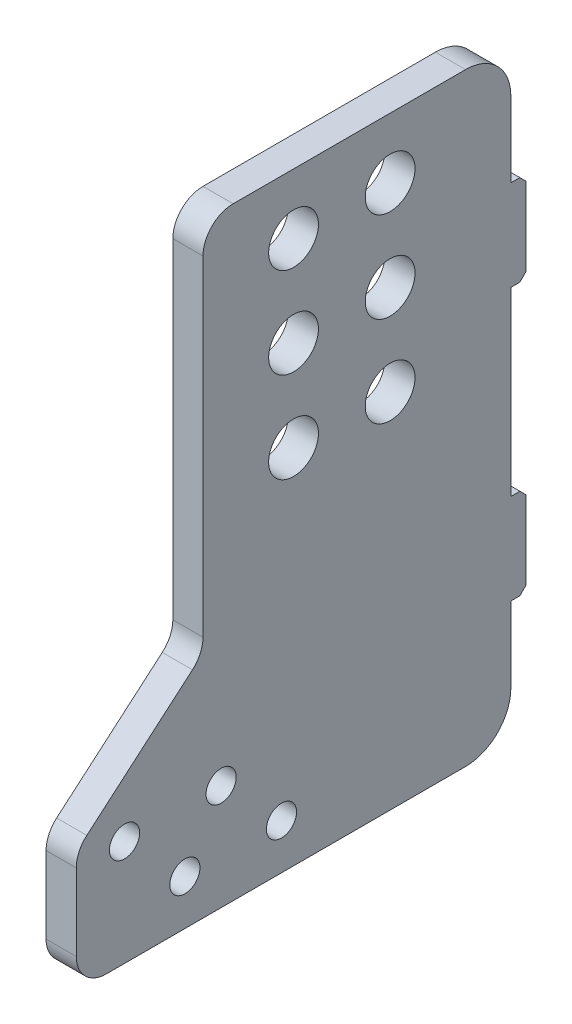
ISO-10303-21;
HEADER;
FILE_DESCRIPTION(('STEP AP214'),'2;1');
FILE_NAME('part.step','',(''),(''),'','','');
FILE_SCHEMA(('AUTOMOTIVE_DESIGN { 1 0 10303 214 1 1 1 1 }'));
ENDSEC;
DATA;
#1=APPLICATION_CONTEXT('core data for automotive mechanical design processes');
#2=APPLICATION_PROTOCOL_DEFINITION('international standard','automotive_design',2000,#1);
#3=PRODUCT_CONTEXT('',#1,'mechanical');
#4=PRODUCT('Part','Part','',(#3));
#5=PRODUCT_RELATED_PRODUCT_CATEGORY('part','',(#4));
#6=PRODUCT_DEFINITION_FORMATION('','',#4);
#7=PRODUCT_DEFINITION_CONTEXT('part definition',#1,'design');
#8=PRODUCT_DEFINITION('design','',#6,#7);
#9=PRODUCT_DEFINITION_SHAPE('','',#8);
#10=(LENGTH_UNIT() NAMED_UNIT(*) SI_UNIT(.MILLI.,.METRE.));
#11=(NAMED_UNIT(*) PLANE_ANGLE_UNIT() SI_UNIT($,.RADIAN.));
#12=(NAMED_UNIT(*) SI_UNIT($,.STERADIAN.) SOLID_ANGLE_UNIT());
#13=UNCERTAINTY_MEASURE_WITH_UNIT(LENGTH_MEASURE(1.E-05),#10,'distance_accuracy_value','');
#14=(GEOMETRIC_REPRESENTATION_CONTEXT(3) GLOBAL_UNCERTAINTY_ASSIGNED_CONTEXT((#13)) GLOBAL_UNIT_ASSIGNED_CONTEXT((#10,
#11,#12)) REPRESENTATION_CONTEXT('',''));
#15=CARTESIAN_POINT('',(0.,0.,0.));
#16=DIRECTION('',(0.,0.,1.));
#17=DIRECTION('',(1.,0.,0.));
#18=AXIS2_PLACEMENT_3D('',#15,#16,#17);
#19=CARTESIAN_POINT('',(23.5,-100.,0.));
#20=DIRECTION('',(0.,0.,1.));
#21=DIRECTION('',(0.,-1.,0.));
#22=AXIS2_PLACEMENT_3D('',#19,#20,#21);
#23=PLANE('',#22);
#24=DIRECTION('',(0.,1.,0.));
#25=VECTOR('',#24,1.);
#26=CARTESIAN_POINT('',(23.5,-100.,0.));
#27=LINE('',#26,#25);
#28=CARTESIAN_POINT('',(23.5,-30.,0.));
#29=VERTEX_POINT('',#28);
#30=CARTESIAN_POINT('',(23.5,30.0000000000001,0.));
#31=VERTEX_POINT('',#30);
#32=EDGE_CURVE('E220',#29,#31,#27,.T.);
#33=ORIENTED_EDGE('',*,*,#32,.F.);
#34=CARTESIAN_POINT('',(23.5,-30.,0.));
#35=CARTESIAN_POINT('',(13.5,-30.,0.));
#36=B_SPLINE_CURVE_WITH_KNOTS('',1,(#34,#35),.UNSPECIFIED.,.F.,.F.,(2,2),(0.,0.125),.UNSPECIFIED.);
#37=CARTESIAN_POINT('',(13.5,-30.,0.));
#38=VERTEX_POINT('',#37);
#39=EDGE_CURVE('E207',#29,#38,#36,.T.);
#40=ORIENTED_EDGE('',*,*,#39,.T.);
#41=DIRECTION('',(0.,1.,0.));
#42=VECTOR('',#41,1.);
#43=CARTESIAN_POINT('',(13.5,-100.,0.));
#44=LINE('',#43,#42);
#45=CARTESIAN_POINT('',(13.5,30.0000000000002,0.));
#46=VERTEX_POINT('',#45);
#47=EDGE_CURVE('E218',#38,#46,#44,.T.);
#48=ORIENTED_EDGE('',*,*,#47,.T.);
#49=CARTESIAN_POINT('',(13.5,30.0000000000002,0.));
#50=CARTESIAN_POINT('',(23.5,30.0000000000002,0.));
#51=B_SPLINE_CURVE_WITH_KNOTS('',1,(#49,#50),.UNSPECIFIED.,.F.,.F.,(2,2),(0.5,0.625),.UNSPECIFIED.);
#52=EDGE_CURVE('E372',#46,#31,#51,.T.);
#53=ORIENTED_EDGE('',*,*,#52,.T.);
#54=EDGE_LOOP('',(#33,#40,#48,#53));
#55=FACE_BOUND('',#54,.T.);
#56=ADVANCED_FACE('F38',(#55),#23,.F.);
#57=CARTESIAN_POINT('',(13.5,60.0000000000002,0.));
#58=VERTEX_POINT('',#57);
#59=CARTESIAN_POINT('',(13.5,85.0000000000002,0.));
#60=VERTEX_POINT('',#59);
#61=EDGE_CURVE('E230',#58,#60,#44,.T.);
#62=ORIENTED_EDGE('',*,*,#61,.T.);
#63=DIRECTION('',(-1.,0.,0.));
#64=VECTOR('',#63,1.);
#65=CARTESIAN_POINT('',(23.5,85.0000000000002,0.));
#66=LINE('',#65,#64);
#67=CARTESIAN_POINT('',(23.5,85.0000000000002,0.));
#68=VERTEX_POINT('',#67);
#69=EDGE_CURVE('E279',#60,#68,#66,.F.);
#70=ORIENTED_EDGE('',*,*,#69,.T.);
#71=CARTESIAN_POINT('',(23.5,60.0000000000002,0.));
#72=VERTEX_POINT('',#71);
#73=EDGE_CURVE('E328',#72,#68,#27,.T.);
#74=ORIENTED_EDGE('',*,*,#73,.F.);
#75=CARTESIAN_POINT('',(23.5,60.0000000000002,0.));
#76=CARTESIAN_POINT('',(13.5,60.0000000000002,0.));
#77=B_SPLINE_CURVE_WITH_KNOTS('',1,(#75,#76),.UNSPECIFIED.,.F.,.F.,(2,2),(0.,0.125),.UNSPECIFIED.);
#78=EDGE_CURVE('E368',#72,#58,#77,.T.);
#79=ORIENTED_EDGE('',*,*,#78,.T.);
#80=EDGE_LOOP('',(#62,#70,#74,#79));
#81=FACE_BOUND('',#80,.T.);
#82=ADVANCED_FACE('F354',(#81),#23,.F.);
#83=CARTESIAN_POINT('',(23.5,90.0000000000002,92.));
#84=DIRECTION('',(1.,0.,0.));
#85=DIRECTION('',(0.,0.,-1.));
#86=AXIS2_PLACEMENT_3D('',#83,#84,#85);
#87=PLANE('',#86);
#88=CARTESIAN_POINT('',(23.5,-65.0000000000005,128.));
#89=DIRECTION('',(1.,0.,0.));
#90=DIRECTION('',(0.,0.,-1.));
#91=AXIS2_PLACEMENT_3D('',#88,#89,#90);
#92=CIRCLE('',#91,4.99999999999999);
#93=CARTESIAN_POINT('',(23.5,-65.0000000000005,123.));
#94=VERTEX_POINT('',#93);
#95=EDGE_CURVE('E420',#94,#94,#92,.T.);
#96=ORIENTED_EDGE('',*,*,#95,.F.);
#97=EDGE_LOOP('',(#96));
#98=FACE_BOUND('',#97,.T.);
#99=CARTESIAN_POINT('',(23.5,-85.,76.));
#100=DIRECTION('',(1.,0.,0.));
#101=DIRECTION('',(0.,0.,-1.));
#102=AXIS2_PLACEMENT_3D('',#99,#100,#101);
#103=CIRCLE('',#102,5.00000000000002);
#104=CARTESIAN_POINT('',(23.5,-85.,71.));
#105=VERTEX_POINT('',#104);
#106=EDGE_CURVE('E432',#105,#105,#103,.T.);
#107=ORIENTED_EDGE('',*,*,#106,.F.);
#108=EDGE_LOOP('',(#107));
#109=FACE_BOUND('',#108,.T.);
#110=CARTESIAN_POINT('',(23.5,50.0000000000002,40.));
#111=DIRECTION('',(1.,0.,0.));
#112=DIRECTION('',(0.,0.,-1.));
#113=AXIS2_PLACEMENT_3D('',#110,#111,#112);
#114=CIRCLE('',#113,8.25000000000001);
#115=CARTESIAN_POINT('',(23.5,50.0000000000002,31.75));
#116=VERTEX_POINT('',#115);
#117=EDGE_CURVE('E444',#116,#116,#114,.T.);
#118=ORIENTED_EDGE('',*,*,#117,.F.);
#119=EDGE_LOOP('',(#118));
#120=FACE_BOUND('',#119,.T.);
#121=CARTESIAN_POINT('',(23.5,50.,72.));
#122=DIRECTION('',(1.,0.,0.));
#123=DIRECTION('',(0.,0.,-1.));
#124=AXIS2_PLACEMENT_3D('',#121,#122,#123);
#125=CIRCLE('',#124,8.25);
#126=CARTESIAN_POINT('',(23.5,50.,63.75));
#127=VERTEX_POINT('',#126);
#128=EDGE_CURVE('E456',#127,#127,#125,.T.);
#129=ORIENTED_EDGE('',*,*,#128,.F.);
#130=EDGE_LOOP('',(#129));
#131=FACE_BOUND('',#130,.T.);
#132=CARTESIAN_POINT('',(23.5,80.,72.));
#133=DIRECTION('',(1.,0.,0.));
#134=DIRECTION('',(0.,0.,-1.));
#135=AXIS2_PLACEMENT_3D('',#132,#133,#134);
#136=CIRCLE('',#135,8.25000000000001);
#137=CARTESIAN_POINT('',(23.5,80.,63.75));
#138=VERTEX_POINT('',#137);
#139=EDGE_CURVE('E466',#138,#138,#136,.T.);
#140=ORIENTED_EDGE('',*,*,#139,.F.);
#141=EDGE_LOOP('',(#140));
#142=FACE_BOUND('',#141,.T.);
#143=DIRECTION('',(0.,-0.650791373455971,0.759256602365295));
#144=VECTOR('',#143,1.);
#145=CARTESIAN_POINT('',(23.5,-23.9999999999998,102.));
#146=LINE('',#145,#144);
#147=CARTESIAN_POINT('',(23.5,-26.9932167989486,105.49208626544));
#148=VERTEX_POINT('',#147);
#149=CARTESIAN_POINT('',(23.5,-57.0067832010512,140.50791373456));
#150=VERTEX_POINT('',#149);
#151=EDGE_CURVE('E303',#148,#150,#146,.T.);
#152=ORIENTED_EDGE('',*,*,#151,.T.);
#153=CARTESIAN_POINT('',(23.5,-64.5993492247041,134.));
#154=DIRECTION('',(1.,0.,0.));
#155=DIRECTION('',(0.,0.,-1.));
#156=AXIS2_PLACEMENT_3D('',#153,#154,#155);
#157=CIRCLE('',#156,10.);
#158=CARTESIAN_POINT('',(23.5,-64.5993492247041,144.));
#159=VERTEX_POINT('',#158);
#160=EDGE_CURVE('E290',#150,#159,#157,.T.);
#161=ORIENTED_EDGE('',*,*,#160,.T.);
#162=DIRECTION('',(0.,-1.,0.));
#163=VECTOR('',#162,1.);
#164=CARTESIAN_POINT('',(23.5,-60.,144.));
#165=LINE('',#164,#163);
#166=CARTESIAN_POINT('',(23.5,-90.,144.));
#167=VERTEX_POINT('',#166);
#168=EDGE_CURVE('E307',#159,#167,#165,.T.);
#169=ORIENTED_EDGE('',*,*,#168,.T.);
#170=CARTESIAN_POINT('',(23.5,-90.,134.));
#171=DIRECTION('',(1.,0.,0.));
#172=DIRECTION('',(0.,0.,-1.));
#173=AXIS2_PLACEMENT_3D('',#170,#171,#172);
#174=CIRCLE('',#173,9.99999999999999);
#175=CARTESIAN_POINT('',(23.5,-100.,134.));
#176=VERTEX_POINT('',#175);
#177=EDGE_CURVE('E254',#167,#176,#174,.T.);
#178=ORIENTED_EDGE('',*,*,#177,.T.);
#179=DIRECTION('',(0.,0.,-1.));
#180=VECTOR('',#179,1.);
#181=CARTESIAN_POINT('',(23.5,-100.,134.));
#182=LINE('',#181,#180);
#183=CARTESIAN_POINT('',(23.5,-100.,15.));
#184=VERTEX_POINT('',#183);
#185=EDGE_CURVE('E249',#176,#184,#182,.T.);
#186=ORIENTED_EDGE('',*,*,#185,.T.);
#187=CARTESIAN_POINT('',(23.5,-85.,15.));
#188=DIRECTION('',(1.,0.,0.));
#189=DIRECTION('',(0.,0.,-1.));
#190=AXIS2_PLACEMENT_3D('',#187,#188,#189);
#191=CIRCLE('',#190,15.);
#192=CARTESIAN_POINT('',(23.5,-85.,0.));
#193=VERTEX_POINT('',#192);
#194=EDGE_CURVE('E274',#184,#193,#191,.T.);
#195=ORIENTED_EDGE('',*,*,#194,.T.);
#196=CARTESIAN_POINT('',(23.5,-60.,0.));
#197=VERTEX_POINT('',#196);
#198=EDGE_CURVE('E332',#193,#197,#27,.T.);
#199=ORIENTED_EDGE('',*,*,#198,.T.);
#200=DIRECTION('',(0.,0.,1.));
#201=VECTOR('',#200,1.);
#202=CARTESIAN_POINT('',(23.5,-60.,-4.99999999999999));
#203=LINE('',#202,#201);
#204=CARTESIAN_POINT('',(23.5,-60.,-2.99999999999999));
#205=VERTEX_POINT('',#204);
#206=EDGE_CURVE('E518',#205,#197,#203,.T.);
#207=ORIENTED_EDGE('',*,*,#206,.F.);
#208=DIRECTION('',(0.,-0.707106781186548,0.707106781186547));
#209=VECTOR('',#208,1.);
#210=CARTESIAN_POINT('',(23.5,-59.,-3.99999999999999));
#211=LINE('',#210,#209);
#212=CARTESIAN_POINT('',(23.5,-58.,-4.99999999999999));
#213=VERTEX_POINT('',#212);
#214=EDGE_CURVE('E540',#205,#213,#211,.F.);
#215=ORIENTED_EDGE('',*,*,#214,.T.);
#216=CARTESIAN_POINT('',(23.5,-60.,-4.99999999999999));
#217=CARTESIAN_POINT('',(23.5,-30.,-4.99999999999999));
#218=B_SPLINE_CURVE_WITH_KNOTS('',1,(#216,#217),.UNSPECIFIED.,.F.,.F.,(2,2),(0.625,1.),.UNSPECIFIED.);
#219=CARTESIAN_POINT('',(23.5,-32.,-4.99999999999999));
#220=VERTEX_POINT('',#219);
#221=EDGE_CURVE('E214',#213,#220,#218,.T.);
#222=ORIENTED_EDGE('',*,*,#221,.T.);
#223=DIRECTION('',(0.,-0.707106781186548,-0.707106781186547));
#224=VECTOR('',#223,1.);
#225=CARTESIAN_POINT('',(23.5,-46.,-19.));
#226=LINE('',#225,#224);
#227=CARTESIAN_POINT('',(23.5,-30.,-2.99999999999999));
#228=VERTEX_POINT('',#227);
#229=EDGE_CURVE('E538',#220,#228,#226,.F.);
#230=ORIENTED_EDGE('',*,*,#229,.T.);
#231=DIRECTION('',(0.,0.,1.));
#232=VECTOR('',#231,1.);
#233=CARTESIAN_POINT('',(23.5,-30.,-4.99999999999999));
#234=LINE('',#233,#232);
#235=EDGE_CURVE('E530',#228,#29,#234,.T.);
#236=ORIENTED_EDGE('',*,*,#235,.T.);
#237=ORIENTED_EDGE('',*,*,#32,.T.);
#238=DIRECTION('',(0.,0.,1.));
#239=VECTOR('',#238,1.);
#240=CARTESIAN_POINT('',(23.5,30.0000000000002,-4.99999999999999));
#241=LINE('',#240,#239);
#242=CARTESIAN_POINT('',(23.5,30.0000000000002,-2.99999999999999));
#243=VERTEX_POINT('',#242);
#244=EDGE_CURVE('E366',#243,#31,#241,.T.);
#245=ORIENTED_EDGE('',*,*,#244,.F.);
#246=DIRECTION('',(0.,-0.707106781186548,0.707106781186547));
#247=VECTOR('',#246,1.);
#248=CARTESIAN_POINT('',(23.5,31.0000000000002,-3.99999999999999));
#249=LINE('',#248,#247);
#250=CARTESIAN_POINT('',(23.5,32.0000000000002,-4.99999999999999));
#251=VERTEX_POINT('',#250);
#252=EDGE_CURVE('E401',#243,#251,#249,.F.);
#253=ORIENTED_EDGE('',*,*,#252,.T.);
#254=CARTESIAN_POINT('',(23.5,30.0000000000002,-4.99999999999999));
#255=CARTESIAN_POINT('',(23.5,60.0000000000002,-4.99999999999999));
#256=B_SPLINE_CURVE_WITH_KNOTS('',1,(#254,#255),.UNSPECIFIED.,.F.,.F.,(2,2),(0.625,1.),.UNSPECIFIED.);
#257=CARTESIAN_POINT('',(23.5,58.0000000000002,-4.99999999999999));
#258=VERTEX_POINT('',#257);
#259=EDGE_CURVE('E381',#251,#258,#256,.T.);
#260=ORIENTED_EDGE('',*,*,#259,.T.);
#261=DIRECTION('',(0.,-0.707106781186548,-0.707106781186547));
#262=VECTOR('',#261,1.);
#263=CARTESIAN_POINT('',(23.5,44.0000000000002,-19.));
#264=LINE('',#263,#262);
#265=CARTESIAN_POINT('',(23.5,60.0000000000002,-2.99999999999999));
#266=VERTEX_POINT('',#265);
#267=EDGE_CURVE('E361',#258,#266,#264,.F.);
#268=ORIENTED_EDGE('',*,*,#267,.T.);
#269=DIRECTION('',(0.,0.,1.));
#270=VECTOR('',#269,1.);
#271=CARTESIAN_POINT('',(23.5,60.0000000000002,-4.99999999999999));
#272=LINE('',#271,#270);
#273=EDGE_CURVE('E357',#266,#72,#272,.T.);
#274=ORIENTED_EDGE('',*,*,#273,.T.);
#275=ORIENTED_EDGE('',*,*,#73,.T.);
#276=CARTESIAN_POINT('',(23.5,85.0000000000002,15.));
#277=DIRECTION('',(1.,0.,0.));
#278=DIRECTION('',(0.,0.,-1.));
#279=AXIS2_PLACEMENT_3D('',#276,#277,#278);
#280=CIRCLE('',#279,15.);
#281=CARTESIAN_POINT('',(23.5,100.,15.));
#282=VERTEX_POINT('',#281);
#283=EDGE_CURVE('E272',#68,#282,#280,.T.);
#284=ORIENTED_EDGE('',*,*,#283,.T.);
#285=DIRECTION('',(0.,0.,1.));
#286=VECTOR('',#285,1.);
#287=CARTESIAN_POINT('',(23.5,100.,0.));
#288=LINE('',#287,#286);
#289=CARTESIAN_POINT('',(23.5,100.,92.));
#290=VERTEX_POINT('',#289);
#291=EDGE_CURVE('E337',#282,#290,#288,.T.);
#292=ORIENTED_EDGE('',*,*,#291,.T.);
#293=CARTESIAN_POINT('',(23.5,90.0000000000002,92.));
#294=DIRECTION('',(1.,0.,0.));
#295=DIRECTION('',(0.,0.,-1.));
#296=AXIS2_PLACEMENT_3D('',#293,#294,#295);
#297=CIRCLE('',#296,9.99999999999998);
#298=CARTESIAN_POINT('',(23.5,90.0000000000002,102.));
#299=VERTEX_POINT('',#298);
#300=EDGE_CURVE('E310',#290,#299,#297,.T.);
#301=ORIENTED_EDGE('',*,*,#300,.T.);
#302=DIRECTION('',(0.,-1.,0.));
#303=VECTOR('',#302,1.);
#304=CARTESIAN_POINT('',(23.5,90.0000000000002,102.));
#305=LINE('',#304,#303);
#306=CARTESIAN_POINT('',(23.5,-19.4006507752956,102.));
#307=VERTEX_POINT('',#306);
#308=EDGE_CURVE('E305',#299,#307,#305,.T.);
#309=ORIENTED_EDGE('',*,*,#308,.T.);
#310=CARTESIAN_POINT('',(23.5,-19.4006507752957,112.));
#311=DIRECTION('',(1.,0.,0.));
#312=DIRECTION('',(0.,0.,-1.));
#313=AXIS2_PLACEMENT_3D('',#310,#311,#312);
#314=CIRCLE('',#313,10.);
#315=EDGE_CURVE('E11',#307,#148,#314,.F.);
#316=ORIENTED_EDGE('',*,*,#315,.T.);
#317=EDGE_LOOP('',(#152,#161,#169,#178,#186,#195,#199,#207,#215,#222,#230,#236,#237,#245,#253,
#260,#268,#274,#275,#284,#292,#301,#309,#316));
#318=FACE_BOUND('',#317,.T.);
#319=CARTESIAN_POINT('',(23.5,80.0000000000002,40.));
#320=DIRECTION('',(1.,0.,0.));
#321=DIRECTION('',(0.,0.,-1.));
#322=AXIS2_PLACEMENT_3D('',#319,#320,#321);
#323=CIRCLE('',#322,8.25);
#324=CARTESIAN_POINT('',(23.5,80.0000000000002,31.75));
#325=VERTEX_POINT('',#324);
#326=EDGE_CURVE('E462',#325,#325,#323,.T.);
#327=ORIENTED_EDGE('',*,*,#326,.F.);
#328=EDGE_LOOP('',(#327));
#329=FACE_BOUND('',#328,.T.);
#330=CARTESIAN_POINT('',(23.5,20.,72.));
#331=DIRECTION('',(1.,0.,0.));
#332=DIRECTION('',(0.,0.,-1.));
#333=AXIS2_PLACEMENT_3D('',#330,#331,#332);
#334=CIRCLE('',#333,8.25);
#335=CARTESIAN_POINT('',(23.5,20.,63.75));
#336=VERTEX_POINT('',#335);
#337=EDGE_CURVE('E450',#336,#336,#334,.T.);
#338=ORIENTED_EDGE('',*,*,#337,.F.);
#339=EDGE_LOOP('',(#338));
#340=FACE_BOUND('',#339,.T.);
#341=CARTESIAN_POINT('',(23.5,20.0000000000002,40.));
#342=DIRECTION('',(1.,0.,0.));
#343=DIRECTION('',(0.,0.,-1.));
#344=AXIS2_PLACEMENT_3D('',#341,#342,#343);
#345=CIRCLE('',#344,8.25);
#346=CARTESIAN_POINT('',(23.5,20.0000000000002,31.75));
#347=VERTEX_POINT('',#346);
#348=EDGE_CURVE('E438',#347,#347,#345,.T.);
#349=ORIENTED_EDGE('',*,*,#348,.F.);
#350=EDGE_LOOP('',(#349));
#351=FACE_BOUND('',#350,.T.);
#352=CARTESIAN_POINT('',(23.5,-85.0000000000002,108.));
#353=DIRECTION('',(1.,0.,0.));
#354=DIRECTION('',(0.,0.,-1.));
#355=AXIS2_PLACEMENT_3D('',#352,#353,#354);
#356=CIRCLE('',#355,5.00000000000005);
#357=CARTESIAN_POINT('',(23.5,-85.0000000000002,103.));
#358=VERTEX_POINT('',#357);
#359=EDGE_CURVE('E426',#358,#358,#356,.T.);
#360=ORIENTED_EDGE('',*,*,#359,.F.);
#361=EDGE_LOOP('',(#360));
#362=FACE_BOUND('',#361,.T.);
#363=CARTESIAN_POINT('',(23.5,-65.0000000000003,96.));
#364=DIRECTION('',(1.,0.,0.));
#365=DIRECTION('',(0.,0.,-1.));
#366=AXIS2_PLACEMENT_3D('',#363,#364,#365);
#367=CIRCLE('',#366,5.00000000000005);
#368=CARTESIAN_POINT('',(23.5,-65.0000000000003,91.));
#369=VERTEX_POINT('',#368);
#370=EDGE_CURVE('E414',#369,#369,#367,.T.);
#371=ORIENTED_EDGE('',*,*,#370,.F.);
#372=EDGE_LOOP('',(#371));
#373=FACE_BOUND('',#372,.T.);
#374=ADVANCED_FACE('F301',(#98,#109,#120,#131,#142,#318,#329,#340,#351,#362,#373),#87,.T.);
#375=CARTESIAN_POINT('',(13.5,90.0000000000002,92.));
#376=DIRECTION('',(1.,0.,0.));
#377=DIRECTION('',(0.,0.,-1.));
#378=AXIS2_PLACEMENT_3D('',#375,#376,#377);
#379=PLANE('',#378);
#380=DIRECTION('',(0.,-1.,0.));
#381=VECTOR('',#380,1.);
#382=CARTESIAN_POINT('',(13.5,-60.,144.));
#383=LINE('',#382,#381);
#384=CARTESIAN_POINT('',(13.5,-64.5993492247041,144.));
#385=VERTEX_POINT('',#384);
#386=CARTESIAN_POINT('',(13.5,-90.,144.));
#387=VERTEX_POINT('',#386);
#388=EDGE_CURVE('E245',#385,#387,#383,.T.);
#389=ORIENTED_EDGE('',*,*,#388,.F.);
#390=CARTESIAN_POINT('',(13.5,-64.5993492247041,134.));
#391=DIRECTION('',(1.,0.,0.));
#392=DIRECTION('',(0.,0.,-1.));
#393=AXIS2_PLACEMENT_3D('',#390,#391,#392);
#394=CIRCLE('',#393,10.);
#395=CARTESIAN_POINT('',(13.5,-57.0067832010512,140.50791373456));
#396=VERTEX_POINT('',#395);
#397=EDGE_CURVE('E284',#385,#396,#394,.F.);
#398=ORIENTED_EDGE('',*,*,#397,.T.);
#399=DIRECTION('',(0.,-0.650791373455971,0.759256602365295));
#400=VECTOR('',#399,1.);
#401=CARTESIAN_POINT('',(13.5,-23.9999999999998,102.));
#402=LINE('',#401,#400);
#403=CARTESIAN_POINT('',(13.5,-26.9932167989486,105.49208626544));
#404=VERTEX_POINT('',#403);
#405=EDGE_CURVE('E243',#404,#396,#402,.T.);
#406=ORIENTED_EDGE('',*,*,#405,.F.);
#407=CARTESIAN_POINT('',(13.5,-19.4006507752957,112.));
#408=DIRECTION('',(1.,0.,0.));
#409=DIRECTION('',(0.,0.,-1.));
#410=AXIS2_PLACEMENT_3D('',#407,#408,#409);
#411=CIRCLE('',#410,10.);
#412=CARTESIAN_POINT('',(13.5,-19.4006507752956,102.));
#413=VERTEX_POINT('',#412);
#414=EDGE_CURVE('E46',#404,#413,#411,.T.);
#415=ORIENTED_EDGE('',*,*,#414,.T.);
#416=DIRECTION('',(0.,-1.,0.));
#417=VECTOR('',#416,1.);
#418=CARTESIAN_POINT('',(13.5,90.0000000000002,102.));
#419=LINE('',#418,#417);
#420=CARTESIAN_POINT('',(13.5,90.0000000000002,102.));
#421=VERTEX_POINT('',#420);
#422=EDGE_CURVE('E241',#421,#413,#419,.T.);
#423=ORIENTED_EDGE('',*,*,#422,.F.);
#424=CARTESIAN_POINT('',(13.5,90.0000000000002,92.));
#425=DIRECTION('',(1.,0.,0.));
#426=DIRECTION('',(0.,0.,-1.));
#427=AXIS2_PLACEMENT_3D('',#424,#425,#426);
#428=CIRCLE('',#427,9.99999999999998);
#429=CARTESIAN_POINT('',(13.5,100.,92.));
#430=VERTEX_POINT('',#429);
#431=EDGE_CURVE('E239',#430,#421,#428,.T.);
#432=ORIENTED_EDGE('',*,*,#431,.F.);
#433=DIRECTION('',(0.,0.,1.));
#434=VECTOR('',#433,1.);
#435=CARTESIAN_POINT('',(13.5,100.,0.));
#436=LINE('',#435,#434);
#437=CARTESIAN_POINT('',(13.5,100.,15.));
#438=VERTEX_POINT('',#437);
#439=EDGE_CURVE('E232',#438,#430,#436,.T.);
#440=ORIENTED_EDGE('',*,*,#439,.F.);
#441=CARTESIAN_POINT('',(13.5,85.0000000000002,15.));
#442=DIRECTION('',(1.,0.,0.));
#443=DIRECTION('',(0.,0.,-1.));
#444=AXIS2_PLACEMENT_3D('',#441,#442,#443);
#445=CIRCLE('',#444,15.);
#446=EDGE_CURVE('E266',#438,#60,#445,.F.);
#447=ORIENTED_EDGE('',*,*,#446,.T.);
#448=ORIENTED_EDGE('',*,*,#61,.F.);
#449=DIRECTION('',(0.,0.,1.));
#450=VECTOR('',#449,1.);
#451=CARTESIAN_POINT('',(13.5,60.0000000000002,-4.99999999999999));
#452=LINE('',#451,#450);
#453=CARTESIAN_POINT('',(13.5,60.0000000000002,-2.99999999999999));
#454=VERTEX_POINT('',#453);
#455=EDGE_CURVE('E371',#454,#58,#452,.T.);
#456=ORIENTED_EDGE('',*,*,#455,.F.);
#457=DIRECTION('',(0.,0.707106781186548,0.707106781186547));
#458=VECTOR('',#457,1.);
#459=CARTESIAN_POINT('',(13.5,59.0000000000002,-3.99999999999999));
#460=LINE('',#459,#458);
#461=CARTESIAN_POINT('',(13.5,58.0000000000002,-4.99999999999999));
#462=VERTEX_POINT('',#461);
#463=EDGE_CURVE('E407',#454,#462,#460,.F.);
#464=ORIENTED_EDGE('',*,*,#463,.T.);
#465=CARTESIAN_POINT('',(13.5,60.0000000000002,-4.99999999999999));
#466=CARTESIAN_POINT('',(13.5,30.0000000000002,-4.99999999999999));
#467=B_SPLINE_CURVE_WITH_KNOTS('',1,(#465,#466),.UNSPECIFIED.,.F.,.F.,(2,2),(0.125,0.5),.UNSPECIFIED.);
#468=CARTESIAN_POINT('',(13.5,32.0000000000002,-4.99999999999999));
#469=VERTEX_POINT('',#468);
#470=EDGE_CURVE('E374',#462,#469,#467,.T.);
#471=ORIENTED_EDGE('',*,*,#470,.T.);
#472=DIRECTION('',(0.,0.707106781186548,-0.707106781186547));
#473=VECTOR('',#472,1.);
#474=CARTESIAN_POINT('',(13.5,46.0000000000002,-19.));
#475=LINE('',#474,#473);
#476=CARTESIAN_POINT('',(13.5,30.0000000000002,-2.99999999999999));
#477=VERTEX_POINT('',#476);
#478=EDGE_CURVE('E409',#469,#477,#475,.F.);
#479=ORIENTED_EDGE('',*,*,#478,.T.);
#480=DIRECTION('',(0.,0.,1.));
#481=VECTOR('',#480,1.);
#482=CARTESIAN_POINT('',(13.5,30.0000000000002,-4.99999999999999));
#483=LINE('',#482,#481);
#484=EDGE_CURVE('E227',#477,#46,#483,.T.);
#485=ORIENTED_EDGE('',*,*,#484,.T.);
#486=ORIENTED_EDGE('',*,*,#47,.F.);
#487=DIRECTION('',(0.,0.,1.));
#488=VECTOR('',#487,1.);
#489=CARTESIAN_POINT('',(13.5,-30.,-4.99999999999999));
#490=LINE('',#489,#488);
#491=CARTESIAN_POINT('',(13.5,-30.,-2.99999999999999));
#492=VERTEX_POINT('',#491);
#493=EDGE_CURVE('E203',#492,#38,#490,.T.);
#494=ORIENTED_EDGE('',*,*,#493,.F.);
#495=DIRECTION('',(0.,0.707106781186548,0.707106781186547));
#496=VECTOR('',#495,1.);
#497=CARTESIAN_POINT('',(13.5,-31.,-3.99999999999999));
#498=LINE('',#497,#496);
#499=CARTESIAN_POINT('',(13.5,-32.,-4.99999999999999));
#500=VERTEX_POINT('',#499);
#501=EDGE_CURVE('E546',#492,#500,#498,.F.);
#502=ORIENTED_EDGE('',*,*,#501,.T.);
#503=CARTESIAN_POINT('',(13.5,-30.,-4.99999999999999));
#504=CARTESIAN_POINT('',(13.5,-60.,-4.99999999999999));
#505=B_SPLINE_CURVE_WITH_KNOTS('',1,(#503,#504),.UNSPECIFIED.,.F.,.F.,(2,2),(0.125,0.5),.UNSPECIFIED.);
#506=CARTESIAN_POINT('',(13.5,-58.,-4.99999999999999));
#507=VERTEX_POINT('',#506);
#508=EDGE_CURVE('E521',#500,#507,#505,.T.);
#509=ORIENTED_EDGE('',*,*,#508,.T.);
#510=DIRECTION('',(0.,0.707106781186548,-0.707106781186547));
#511=VECTOR('',#510,1.);
#512=CARTESIAN_POINT('',(13.5,-44.,-19.));
#513=LINE('',#512,#511);
#514=CARTESIAN_POINT('',(13.5,-60.,-2.99999999999999));
#515=VERTEX_POINT('',#514);
#516=EDGE_CURVE('E376',#507,#515,#513,.F.);
#517=ORIENTED_EDGE('',*,*,#516,.T.);
#518=DIRECTION('',(0.,0.,1.));
#519=VECTOR('',#518,1.);
#520=CARTESIAN_POINT('',(13.5,-60.,-4.99999999999999));
#521=LINE('',#520,#519);
#522=CARTESIAN_POINT('',(13.5,-60.,0.));
#523=VERTEX_POINT('',#522);
#524=EDGE_CURVE('E213',#515,#523,#521,.T.);
#525=ORIENTED_EDGE('',*,*,#524,.T.);
#526=CARTESIAN_POINT('',(13.5,-85.,0.));
#527=VERTEX_POINT('',#526);
#528=EDGE_CURVE('E229',#527,#523,#44,.T.);
#529=ORIENTED_EDGE('',*,*,#528,.F.);
#530=CARTESIAN_POINT('',(13.5,-85.,15.));
#531=DIRECTION('',(1.,0.,0.));
#532=DIRECTION('',(0.,0.,-1.));
#533=AXIS2_PLACEMENT_3D('',#530,#531,#532);
#534=CIRCLE('',#533,15.);
#535=CARTESIAN_POINT('',(13.5,-100.,15.));
#536=VERTEX_POINT('',#535);
#537=EDGE_CURVE('E268',#527,#536,#534,.F.);
#538=ORIENTED_EDGE('',*,*,#537,.T.);
#539=DIRECTION('',(0.,0.,-1.));
#540=VECTOR('',#539,1.);
#541=CARTESIAN_POINT('',(13.5,-100.,134.));
#542=LINE('',#541,#540);
#543=CARTESIAN_POINT('',(13.5,-100.,134.));
#544=VERTEX_POINT('',#543);
#545=EDGE_CURVE('E234',#544,#536,#542,.T.);
#546=ORIENTED_EDGE('',*,*,#545,.F.);
#547=CARTESIAN_POINT('',(13.5,-90.,134.));
#548=DIRECTION('',(1.,0.,0.));
#549=DIRECTION('',(0.,0.,-1.));
#550=AXIS2_PLACEMENT_3D('',#547,#548,#549);
#551=CIRCLE('',#550,9.99999999999999);
#552=EDGE_CURVE('E247',#387,#544,#551,.T.);
#553=ORIENTED_EDGE('',*,*,#552,.F.);
#554=EDGE_LOOP('',(#389,#398,#406,#415,#423,#432,#440,#447,#448,#456,#464,#471,#479,#485,#486,
#494,#502,#509,#517,#525,#529,#538,#546,#553));
#555=FACE_BOUND('',#554,.T.);
#556=CARTESIAN_POINT('',(13.5,80.,72.));
#557=DIRECTION('',(1.,0.,0.));
#558=DIRECTION('',(0.,0.,-1.));
#559=AXIS2_PLACEMENT_3D('',#556,#557,#558);
#560=CIRCLE('',#559,8.25000000000001);
#561=CARTESIAN_POINT('',(13.5,80.,63.75));
#562=VERTEX_POINT('',#561);
#563=EDGE_CURVE('E334',#562,#562,#560,.T.);
#564=ORIENTED_EDGE('',*,*,#563,.T.);
#565=EDGE_LOOP('',(#564));
#566=FACE_BOUND('',#565,.T.);
#567=CARTESIAN_POINT('',(13.5,80.0000000000002,40.));
#568=DIRECTION('',(1.,0.,0.));
#569=DIRECTION('',(0.,0.,-1.));
#570=AXIS2_PLACEMENT_3D('',#567,#568,#569);
#571=CIRCLE('',#570,8.25);
#572=CARTESIAN_POINT('',(13.5,80.0000000000002,31.75));
#573=VERTEX_POINT('',#572);
#574=EDGE_CURVE('E459',#573,#573,#571,.T.);
#575=ORIENTED_EDGE('',*,*,#574,.T.);
#576=EDGE_LOOP('',(#575));
#577=FACE_BOUND('',#576,.T.);
#578=CARTESIAN_POINT('',(13.5,50.,72.));
#579=DIRECTION('',(1.,0.,0.));
#580=DIRECTION('',(0.,0.,-1.));
#581=AXIS2_PLACEMENT_3D('',#578,#579,#580);
#582=CIRCLE('',#581,8.25);
#583=CARTESIAN_POINT('',(13.5,50.,63.75));
#584=VERTEX_POINT('',#583);
#585=EDGE_CURVE('E453',#584,#584,#582,.T.);
#586=ORIENTED_EDGE('',*,*,#585,.T.);
#587=EDGE_LOOP('',(#586));
#588=FACE_BOUND('',#587,.T.);
#589=CARTESIAN_POINT('',(13.5,20.,72.));
#590=DIRECTION('',(1.,0.,0.));
#591=DIRECTION('',(0.,0.,-1.));
#592=AXIS2_PLACEMENT_3D('',#589,#590,#591);
#593=CIRCLE('',#592,8.25);
#594=CARTESIAN_POINT('',(13.5,20.,63.75));
#595=VERTEX_POINT('',#594);
#596=EDGE_CURVE('E447',#595,#595,#593,.T.);
#597=ORIENTED_EDGE('',*,*,#596,.T.);
#598=EDGE_LOOP('',(#597));
#599=FACE_BOUND('',#598,.T.);
#600=CARTESIAN_POINT('',(13.5,50.0000000000002,40.));
#601=DIRECTION('',(1.,0.,0.));
#602=DIRECTION('',(0.,0.,-1.));
#603=AXIS2_PLACEMENT_3D('',#600,#601,#602);
#604=CIRCLE('',#603,8.25000000000001);
#605=CARTESIAN_POINT('',(13.5,50.0000000000002,31.75));
#606=VERTEX_POINT('',#605);
#607=EDGE_CURVE('E441',#606,#606,#604,.T.);
#608=ORIENTED_EDGE('',*,*,#607,.T.);
#609=EDGE_LOOP('',(#608));
#610=FACE_BOUND('',#609,.T.);
#611=CARTESIAN_POINT('',(13.5,20.0000000000002,40.));
#612=DIRECTION('',(1.,0.,0.));
#613=DIRECTION('',(0.,0.,-1.));
#614=AXIS2_PLACEMENT_3D('',#611,#612,#613);
#615=CIRCLE('',#614,8.25);
#616=CARTESIAN_POINT('',(13.5,20.0000000000002,31.75));
#617=VERTEX_POINT('',#616);
#618=EDGE_CURVE('E435',#617,#617,#615,.T.);
#619=ORIENTED_EDGE('',*,*,#618,.T.);
#620=EDGE_LOOP('',(#619));
#621=FACE_BOUND('',#620,.T.);
#622=CARTESIAN_POINT('',(13.5,-85.,76.));
#623=DIRECTION('',(1.,0.,0.));
#624=DIRECTION('',(0.,0.,-1.));
#625=AXIS2_PLACEMENT_3D('',#622,#623,#624);
#626=CIRCLE('',#625,5.00000000000002);
#627=CARTESIAN_POINT('',(13.5,-85.,71.));
#628=VERTEX_POINT('',#627);
#629=EDGE_CURVE('E429',#628,#628,#626,.T.);
#630=ORIENTED_EDGE('',*,*,#629,.T.);
#631=EDGE_LOOP('',(#630));
#632=FACE_BOUND('',#631,.T.);
#633=CARTESIAN_POINT('',(13.5,-85.0000000000002,108.));
#634=DIRECTION('',(1.,0.,0.));
#635=DIRECTION('',(0.,0.,-1.));
#636=AXIS2_PLACEMENT_3D('',#633,#634,#635);
#637=CIRCLE('',#636,5.00000000000005);
#638=CARTESIAN_POINT('',(13.5,-85.0000000000002,103.));
#639=VERTEX_POINT('',#638);
#640=EDGE_CURVE('E423',#639,#639,#637,.T.);
#641=ORIENTED_EDGE('',*,*,#640,.T.);
#642=EDGE_LOOP('',(#641));
#643=FACE_BOUND('',#642,.T.);
#644=CARTESIAN_POINT('',(13.5,-65.0000000000005,128.));
#645=DIRECTION('',(1.,0.,0.));
#646=DIRECTION('',(0.,0.,-1.));
#647=AXIS2_PLACEMENT_3D('',#644,#645,#646);
#648=CIRCLE('',#647,4.99999999999999);
#649=CARTESIAN_POINT('',(13.5,-65.0000000000005,123.));
#650=VERTEX_POINT('',#649);
#651=EDGE_CURVE('E417',#650,#650,#648,.T.);
#652=ORIENTED_EDGE('',*,*,#651,.T.);
#653=EDGE_LOOP('',(#652));
#654=FACE_BOUND('',#653,.T.);
#655=CARTESIAN_POINT('',(13.5,-65.0000000000003,96.));
#656=DIRECTION('',(1.,0.,0.));
#657=DIRECTION('',(0.,0.,-1.));
#658=AXIS2_PLACEMENT_3D('',#655,#656,#657);
#659=CIRCLE('',#658,5.00000000000005);
#660=CARTESIAN_POINT('',(13.5,-65.0000000000003,91.));
#661=VERTEX_POINT('',#660);
#662=EDGE_CURVE('E413',#661,#661,#659,.T.);
#663=ORIENTED_EDGE('',*,*,#662,.T.);
#664=EDGE_LOOP('',(#663));
#665=FACE_BOUND('',#664,.T.);
#666=ADVANCED_FACE('F224',(#555,#566,#577,#588,#599,#610,#621,#632,#643,#654,#665),#379,.F.);
#667=CARTESIAN_POINT('',(23.5,-100.,134.));
#668=DIRECTION('',(0.,1.,0.));
#669=DIRECTION('',(0.,0.,1.));
#670=AXIS2_PLACEMENT_3D('',#667,#668,#669);
#671=PLANE('',#670);
#672=ORIENTED_EDGE('',*,*,#545,.T.);
#673=DIRECTION('',(-1.,0.,0.));
#674=VECTOR('',#673,1.);
#675=CARTESIAN_POINT('',(23.5,-100.,15.));
#676=LINE('',#675,#674);
#677=EDGE_CURVE('E270',#536,#184,#676,.F.);
#678=ORIENTED_EDGE('',*,*,#677,.T.);
#679=ORIENTED_EDGE('',*,*,#185,.F.);
#680=DIRECTION('',(-1.,0.,0.));
#681=VECTOR('',#680,1.);
#682=CARTESIAN_POINT('',(23.5,-100.,134.));
#683=LINE('',#682,#681);
#684=EDGE_CURVE('E250',#176,#544,#683,.T.);
#685=ORIENTED_EDGE('',*,*,#684,.T.);
#686=EDGE_LOOP('',(#672,#678,#679,#685));
#687=FACE_BOUND('',#686,.T.);
#688=ADVANCED_FACE('F326',(#687),#671,.F.);
#689=ORIENTED_EDGE('',*,*,#198,.F.);
#690=DIRECTION('',(-1.,0.,0.));
#691=VECTOR('',#690,1.);
#692=CARTESIAN_POINT('',(23.5,-85.,0.));
#693=LINE('',#692,#691);
#694=EDGE_CURVE('E263',#193,#527,#693,.T.);
#695=ORIENTED_EDGE('',*,*,#694,.T.);
#696=ORIENTED_EDGE('',*,*,#528,.T.);
#697=CARTESIAN_POINT('',(13.5,-60.,0.));
#698=CARTESIAN_POINT('',(23.5,-60.,0.));
#699=B_SPLINE_CURVE_WITH_KNOTS('',1,(#697,#698),.UNSPECIFIED.,.F.,.F.,(2,2),(0.5,0.625),.UNSPECIFIED.);
#700=EDGE_CURVE('E221',#523,#197,#699,.T.);
#701=ORIENTED_EDGE('',*,*,#700,.T.);
#702=EDGE_LOOP('',(#689,#695,#696,#701));
#703=FACE_BOUND('',#702,.T.);
#704=ADVANCED_FACE('F490',(#703),#23,.F.);
#705=CARTESIAN_POINT('',(23.5,100.,0.));
#706=DIRECTION('',(0.,-1.,0.));
#707=DIRECTION('',(0.,0.,-1.));
#708=AXIS2_PLACEMENT_3D('',#705,#706,#707);
#709=PLANE('',#708);
#710=ORIENTED_EDGE('',*,*,#291,.F.);
#711=DIRECTION('',(-1.,0.,0.));
#712=VECTOR('',#711,1.);
#713=CARTESIAN_POINT('',(23.5,100.,15.));
#714=LINE('',#713,#712);
#715=EDGE_CURVE('E276',#282,#438,#714,.T.);
#716=ORIENTED_EDGE('',*,*,#715,.T.);
#717=ORIENTED_EDGE('',*,*,#439,.T.);
#718=DIRECTION('',(-1.,0.,0.));
#719=VECTOR('',#718,1.);
#720=CARTESIAN_POINT('',(23.5,100.,92.));
#721=LINE('',#720,#719);
#722=EDGE_CURVE('E260',#290,#430,#721,.T.);
#723=ORIENTED_EDGE('',*,*,#722,.F.);
#724=EDGE_LOOP('',(#710,#716,#717,#723));
#725=FACE_BOUND('',#724,.T.);
#726=ADVANCED_FACE('F346',(#725),#709,.F.);
#727=CARTESIAN_POINT('',(23.5,90.0000000000002,92.));
#728=DIRECTION('',(-1.,0.,0.));
#729=DIRECTION('',(0.,0.,1.));
#730=AXIS2_PLACEMENT_3D('',#727,#728,#729);
#731=CYLINDRICAL_SURFACE('',#730,9.99999999999998);
#732=ORIENTED_EDGE('',*,*,#431,.T.);
#733=DIRECTION('',(-1.,0.,0.));
#734=VECTOR('',#733,1.);
#735=CARTESIAN_POINT('',(23.5,90.0000000000002,102.));
#736=LINE('',#735,#734);
#737=EDGE_CURVE('E257',#299,#421,#736,.T.);
#738=ORIENTED_EDGE('',*,*,#737,.F.);
#739=ORIENTED_EDGE('',*,*,#300,.F.);
#740=ORIENTED_EDGE('',*,*,#722,.T.);
#741=EDGE_LOOP('',(#732,#738,#739,#740));
#742=FACE_BOUND('',#741,.T.);
#743=ADVANCED_FACE('F342',(#742),#731,.T.);
#744=CARTESIAN_POINT('',(23.5,90.0000000000002,102.));
#745=DIRECTION('',(0.,0.,-1.));
#746=DIRECTION('',(0.,1.,0.));
#747=AXIS2_PLACEMENT_3D('',#744,#745,#746);
#748=PLANE('',#747);
#749=ORIENTED_EDGE('',*,*,#422,.T.);
#750=DIRECTION('',(-1.,0.,0.));
#751=VECTOR('',#750,1.);
#752=CARTESIAN_POINT('',(23.5,-19.4006507752957,102.));
#753=LINE('',#752,#751);
#754=EDGE_CURVE('E53',#413,#307,#753,.F.);
#755=ORIENTED_EDGE('',*,*,#754,.T.);
#756=ORIENTED_EDGE('',*,*,#308,.F.);
#757=ORIENTED_EDGE('',*,*,#737,.T.);
#758=EDGE_LOOP('',(#749,#755,#756,#757));
#759=FACE_BOUND('',#758,.T.);
#760=ADVANCED_FACE('F297',(#759),#748,.F.);
#761=CARTESIAN_POINT('',(23.5,-23.9999999999998,102.));
#762=DIRECTION('',(0.,-0.759256602365295,-0.650791373455971));
#763=DIRECTION('',(0.,0.650791373455971,-0.759256602365295));
#764=AXIS2_PLACEMENT_3D('',#761,#762,#763);
#765=PLANE('',#764);
#766=ORIENTED_EDGE('',*,*,#405,.T.);
#767=DIRECTION('',(-1.,0.,0.));
#768=VECTOR('',#767,1.);
#769=CARTESIAN_POINT('',(23.5,-57.0067832010512,140.50791373456));
#770=LINE('',#769,#768);
#771=EDGE_CURVE('E61',#396,#150,#770,.F.);
#772=ORIENTED_EDGE('',*,*,#771,.T.);
#773=ORIENTED_EDGE('',*,*,#151,.F.);
#774=DIRECTION('',(-1.,0.,0.));
#775=VECTOR('',#774,1.);
#776=CARTESIAN_POINT('',(13.5,-26.9932167989486,105.49208626544));
#777=LINE('',#776,#775);
#778=EDGE_CURVE('E286',#148,#404,#777,.T.);
#779=ORIENTED_EDGE('',*,*,#778,.T.);
#780=EDGE_LOOP('',(#766,#772,#773,#779));
#781=FACE_BOUND('',#780,.T.);
#782=ADVANCED_FACE('F306',(#781),#765,.F.);
#783=CARTESIAN_POINT('',(23.5,-60.,144.));
#784=DIRECTION('',(0.,0.,-1.));
#785=DIRECTION('',(0.,1.,0.));
#786=AXIS2_PLACEMENT_3D('',#783,#784,#785);
#787=PLANE('',#786);
#788=ORIENTED_EDGE('',*,*,#168,.F.);
#789=DIRECTION('',(-1.,0.,0.));
#790=VECTOR('',#789,1.);
#791=CARTESIAN_POINT('',(23.5,-64.5993492247041,144.));
#792=LINE('',#791,#790);
#793=EDGE_CURVE('E281',#159,#385,#792,.T.);
#794=ORIENTED_EDGE('',*,*,#793,.T.);
#795=ORIENTED_EDGE('',*,*,#388,.T.);
#796=DIRECTION('',(-1.,0.,0.));
#797=VECTOR('',#796,1.);
#798=CARTESIAN_POINT('',(23.5,-90.,144.));
#799=LINE('',#798,#797);
#800=EDGE_CURVE('E253',#167,#387,#799,.T.);
#801=ORIENTED_EDGE('',*,*,#800,.F.);
#802=EDGE_LOOP('',(#788,#794,#795,#801));
#803=FACE_BOUND('',#802,.T.);
#804=ADVANCED_FACE('F485',(#803),#787,.F.);
#805=CARTESIAN_POINT('',(23.5,-90.,134.));
#806=DIRECTION('',(-1.,0.,0.));
#807=DIRECTION('',(0.,0.,1.));
#808=AXIS2_PLACEMENT_3D('',#805,#806,#807);
#809=CYLINDRICAL_SURFACE('',#808,9.99999999999999);
#810=ORIENTED_EDGE('',*,*,#552,.T.);
#811=ORIENTED_EDGE('',*,*,#684,.F.);
#812=ORIENTED_EDGE('',*,*,#177,.F.);
#813=ORIENTED_EDGE('',*,*,#800,.T.);
#814=EDGE_LOOP('',(#810,#811,#812,#813));
#815=FACE_BOUND('',#814,.T.);
#816=ADVANCED_FACE('F321',(#815),#809,.T.);
#817=CARTESIAN_POINT('',(23.5,80.,72.));
#818=DIRECTION('',(-1.,0.,0.));
#819=DIRECTION('',(0.,0.,1.));
#820=AXIS2_PLACEMENT_3D('',#817,#818,#819);
#821=CYLINDRICAL_SURFACE('',#820,8.25000000000001);
#822=ORIENTED_EDGE('',*,*,#139,.T.);
#823=EDGE_LOOP('',(#822));
#824=FACE_BOUND('',#823,.T.);
#825=ORIENTED_EDGE('',*,*,#563,.F.);
#826=EDGE_LOOP('',(#825));
#827=FACE_BOUND('',#826,.T.);
#828=ADVANCED_FACE('F474',(#824,#827),#821,.F.);
#829=CARTESIAN_POINT('',(23.5,80.0000000000002,40.));
#830=DIRECTION('',(-1.,0.,0.));
#831=DIRECTION('',(0.,0.,1.));
#832=AXIS2_PLACEMENT_3D('',#829,#830,#831);
#833=CYLINDRICAL_SURFACE('',#832,8.25);
#834=ORIENTED_EDGE('',*,*,#326,.T.);
#835=EDGE_LOOP('',(#834));
#836=FACE_BOUND('',#835,.T.);
#837=ORIENTED_EDGE('',*,*,#574,.F.);
#838=EDGE_LOOP('',(#837));
#839=FACE_BOUND('',#838,.T.);
#840=ADVANCED_FACE('F476',(#836,#839),#833,.F.);
#841=CARTESIAN_POINT('',(23.5,50.,72.));
#842=DIRECTION('',(-1.,0.,0.));
#843=DIRECTION('',(0.,0.,1.));
#844=AXIS2_PLACEMENT_3D('',#841,#842,#843);
#845=CYLINDRICAL_SURFACE('',#844,8.25);
#846=ORIENTED_EDGE('',*,*,#128,.T.);
#847=EDGE_LOOP('',(#846));
#848=FACE_BOUND('',#847,.T.);
#849=ORIENTED_EDGE('',*,*,#585,.F.);
#850=EDGE_LOOP('',(#849));
#851=FACE_BOUND('',#850,.T.);
#852=ADVANCED_FACE('F482',(#848,#851),#845,.F.);
#853=CARTESIAN_POINT('',(23.5,20.,72.));
#854=DIRECTION('',(-1.,0.,0.));
#855=DIRECTION('',(0.,0.,1.));
#856=AXIS2_PLACEMENT_3D('',#853,#854,#855);
#857=CYLINDRICAL_SURFACE('',#856,8.25);
#858=ORIENTED_EDGE('',*,*,#337,.T.);
#859=EDGE_LOOP('',(#858));
#860=FACE_BOUND('',#859,.T.);
#861=ORIENTED_EDGE('',*,*,#596,.F.);
#862=EDGE_LOOP('',(#861));
#863=FACE_BOUND('',#862,.T.);
#864=ADVANCED_FACE('F647',(#860,#863),#857,.F.);
#865=CARTESIAN_POINT('',(23.5,50.0000000000002,40.));
#866=DIRECTION('',(-1.,0.,0.));
#867=DIRECTION('',(0.,0.,1.));
#868=AXIS2_PLACEMENT_3D('',#865,#866,#867);
#869=CYLINDRICAL_SURFACE('',#868,8.25000000000001);
#870=ORIENTED_EDGE('',*,*,#117,.T.);
#871=EDGE_LOOP('',(#870));
#872=FACE_BOUND('',#871,.T.);
#873=ORIENTED_EDGE('',*,*,#607,.F.);
#874=EDGE_LOOP('',(#873));
#875=FACE_BOUND('',#874,.T.);
#876=ADVANCED_FACE('F643',(#872,#875),#869,.F.);
#877=CARTESIAN_POINT('',(23.5,20.0000000000002,40.));
#878=DIRECTION('',(-1.,0.,0.));
#879=DIRECTION('',(0.,0.,1.));
#880=AXIS2_PLACEMENT_3D('',#877,#878,#879);
#881=CYLINDRICAL_SURFACE('',#880,8.25);
#882=ORIENTED_EDGE('',*,*,#348,.T.);
#883=EDGE_LOOP('',(#882));
#884=FACE_BOUND('',#883,.T.);
#885=ORIENTED_EDGE('',*,*,#618,.F.);
#886=EDGE_LOOP('',(#885));
#887=FACE_BOUND('',#886,.T.);
#888=ADVANCED_FACE('F639',(#884,#887),#881,.F.);
#889=CARTESIAN_POINT('',(23.5,-85.,76.));
#890=DIRECTION('',(-1.,0.,0.));
#891=DIRECTION('',(0.,0.,1.));
#892=AXIS2_PLACEMENT_3D('',#889,#890,#891);
#893=CYLINDRICAL_SURFACE('',#892,5.00000000000002);
#894=ORIENTED_EDGE('',*,*,#106,.T.);
#895=EDGE_LOOP('',(#894));
#896=FACE_BOUND('',#895,.T.);
#897=ORIENTED_EDGE('',*,*,#629,.F.);
#898=EDGE_LOOP('',(#897));
#899=FACE_BOUND('',#898,.T.);
#900=ADVANCED_FACE('F635',(#896,#899),#893,.F.);
#901=CARTESIAN_POINT('',(23.5,-85.0000000000002,108.));
#902=DIRECTION('',(-1.,0.,0.));
#903=DIRECTION('',(0.,0.,1.));
#904=AXIS2_PLACEMENT_3D('',#901,#902,#903);
#905=CYLINDRICAL_SURFACE('',#904,5.00000000000005);
#906=ORIENTED_EDGE('',*,*,#359,.T.);
#907=EDGE_LOOP('',(#906));
#908=FACE_BOUND('',#907,.T.);
#909=ORIENTED_EDGE('',*,*,#640,.F.);
#910=EDGE_LOOP('',(#909));
#911=FACE_BOUND('',#910,.T.);
#912=ADVANCED_FACE('F631',(#908,#911),#905,.F.);
#913=CARTESIAN_POINT('',(23.5,-65.0000000000005,128.));
#914=DIRECTION('',(-1.,0.,0.));
#915=DIRECTION('',(0.,0.,1.));
#916=AXIS2_PLACEMENT_3D('',#913,#914,#915);
#917=CYLINDRICAL_SURFACE('',#916,4.99999999999999);
#918=ORIENTED_EDGE('',*,*,#95,.T.);
#919=EDGE_LOOP('',(#918));
#920=FACE_BOUND('',#919,.T.);
#921=ORIENTED_EDGE('',*,*,#651,.F.);
#922=EDGE_LOOP('',(#921));
#923=FACE_BOUND('',#922,.T.);
#924=ADVANCED_FACE('F627',(#920,#923),#917,.F.);
#925=CARTESIAN_POINT('',(23.5,-65.0000000000003,96.));
#926=DIRECTION('',(-1.,0.,0.));
#927=DIRECTION('',(0.,0.,1.));
#928=AXIS2_PLACEMENT_3D('',#925,#926,#927);
#929=CYLINDRICAL_SURFACE('',#928,5.00000000000005);
#930=ORIENTED_EDGE('',*,*,#370,.T.);
#931=EDGE_LOOP('',(#930));
#932=FACE_BOUND('',#931,.T.);
#933=ORIENTED_EDGE('',*,*,#662,.F.);
#934=EDGE_LOOP('',(#933));
#935=FACE_BOUND('',#934,.T.);
#936=ADVANCED_FACE('F615',(#932,#935),#929,.F.);
#937=CARTESIAN_POINT('',(23.5,60.0000000000002,-4.99999999999999));
#938=DIRECTION('',(0.,1.,0.));
#939=DIRECTION('',(0.,0.,1.));
#940=AXIS2_PLACEMENT_3D('',#937,#938,#939);
#941=PLANE('',#940);
#942=ORIENTED_EDGE('',*,*,#273,.F.);
#943=DIRECTION('',(-1.,0.,0.));
#944=VECTOR('',#943,1.);
#945=CARTESIAN_POINT('',(23.5,60.0000000000002,-2.99999999999999));
#946=LINE('',#945,#944);
#947=EDGE_CURVE('E411',#266,#454,#946,.T.);
#948=ORIENTED_EDGE('',*,*,#947,.T.);
#949=ORIENTED_EDGE('',*,*,#455,.T.);
#950=ORIENTED_EDGE('',*,*,#78,.F.);
#951=EDGE_LOOP('',(#942,#948,#949,#950));
#952=FACE_BOUND('',#951,.T.);
#953=ADVANCED_FACE('F369',(#952),#941,.T.);
#954=CARTESIAN_POINT('',(13.5,30.0000000000002,-4.99999999999999));
#955=DIRECTION('',(0.,-1.,0.));
#956=DIRECTION('',(0.,0.,-1.));
#957=AXIS2_PLACEMENT_3D('',#954,#955,#956);
#958=PLANE('',#957);
#959=ORIENTED_EDGE('',*,*,#484,.F.);
#960=DIRECTION('',(1.,0.,0.));
#961=VECTOR('',#960,1.);
#962=CARTESIAN_POINT('',(13.5,30.0000000000002,-2.99999999999999));
#963=LINE('',#962,#961);
#964=EDGE_CURVE('E365',#477,#243,#963,.T.);
#965=ORIENTED_EDGE('',*,*,#964,.T.);
#966=ORIENTED_EDGE('',*,*,#244,.T.);
#967=ORIENTED_EDGE('',*,*,#52,.F.);
#968=EDGE_LOOP('',(#959,#965,#966,#967));
#969=FACE_BOUND('',#968,.T.);
#970=ADVANCED_FACE('F568',(#969),#958,.T.);
#971=CARTESIAN_POINT('',(18.5,60.0000000000002,-4.99999999999999));
#972=DIRECTION('',(0.,0.,-1.));
#973=DIRECTION('',(-1.,0.,0.));
#974=AXIS2_PLACEMENT_3D('',#971,#972,#973);
#975=PLANE('',#974);
#976=ORIENTED_EDGE('',*,*,#259,.F.);
#977=DIRECTION('',(-1.,0.,0.));
#978=VECTOR('',#977,1.);
#979=CARTESIAN_POINT('',(18.5,32.0000000000002,-4.99999999999999));
#980=LINE('',#979,#978);
#981=EDGE_CURVE('E405',#251,#469,#980,.T.);
#982=ORIENTED_EDGE('',*,*,#981,.T.);
#983=ORIENTED_EDGE('',*,*,#470,.F.);
#984=DIRECTION('',(1.,0.,0.));
#985=VECTOR('',#984,1.);
#986=CARTESIAN_POINT('',(18.5,58.0000000000002,-4.99999999999999));
#987=LINE('',#986,#985);
#988=EDGE_CURVE('E403',#462,#258,#987,.T.);
#989=ORIENTED_EDGE('',*,*,#988,.T.);
#990=EDGE_LOOP('',(#976,#982,#983,#989));
#991=FACE_BOUND('',#990,.T.);
#992=ADVANCED_FACE('F563',(#991),#975,.T.);
#993=CARTESIAN_POINT('',(13.5,30.0000000000002,-2.99999999999999));
#994=DIRECTION('',(0.,0.707106781186547,0.707106781186548));
#995=DIRECTION('',(1.,0.,0.));
#996=AXIS2_PLACEMENT_3D('',#993,#994,#995);
#997=PLANE('',#996);
#998=ORIENTED_EDGE('',*,*,#478,.F.);
#999=ORIENTED_EDGE('',*,*,#981,.F.);
#1000=ORIENTED_EDGE('',*,*,#252,.F.);
#1001=ORIENTED_EDGE('',*,*,#964,.F.);
#1002=EDGE_LOOP('',(#998,#999,#1000,#1001));
#1003=FACE_BOUND('',#1002,.T.);
#1004=ADVANCED_FACE('F565',(#1003),#997,.F.);
#1005=CARTESIAN_POINT('',(23.5,60.0000000000002,-2.99999999999999));
#1006=DIRECTION('',(0.,-0.707106781186547,0.707106781186548));
#1007=DIRECTION('',(-1.,0.,0.));
#1008=AXIS2_PLACEMENT_3D('',#1005,#1006,#1007);
#1009=PLANE('',#1008);
#1010=ORIENTED_EDGE('',*,*,#267,.F.);
#1011=ORIENTED_EDGE('',*,*,#988,.F.);
#1012=ORIENTED_EDGE('',*,*,#463,.F.);
#1013=ORIENTED_EDGE('',*,*,#947,.F.);
#1014=EDGE_LOOP('',(#1010,#1011,#1012,#1013));
#1015=FACE_BOUND('',#1014,.T.);
#1016=ADVANCED_FACE('F562',(#1015),#1009,.F.);
#1017=CARTESIAN_POINT('',(23.5,-30.,-4.99999999999999));
#1018=DIRECTION('',(0.,1.,0.));
#1019=DIRECTION('',(0.,0.,1.));
#1020=AXIS2_PLACEMENT_3D('',#1017,#1018,#1019);
#1021=PLANE('',#1020);
#1022=ORIENTED_EDGE('',*,*,#235,.F.);
#1023=DIRECTION('',(-1.,0.,0.));
#1024=VECTOR('',#1023,1.);
#1025=CARTESIAN_POINT('',(23.5,-30.,-2.99999999999999));
#1026=LINE('',#1025,#1024);
#1027=EDGE_CURVE('E210',#228,#492,#1026,.T.);
#1028=ORIENTED_EDGE('',*,*,#1027,.T.);
#1029=ORIENTED_EDGE('',*,*,#493,.T.);
#1030=ORIENTED_EDGE('',*,*,#39,.F.);
#1031=EDGE_LOOP('',(#1022,#1028,#1029,#1030));
#1032=FACE_BOUND('',#1031,.T.);
#1033=ADVANCED_FACE('F206',(#1032),#1021,.T.);
#1034=CARTESIAN_POINT('',(13.5,-60.,-4.99999999999999));
#1035=DIRECTION('',(0.,-1.,0.));
#1036=DIRECTION('',(0.,0.,-1.));
#1037=AXIS2_PLACEMENT_3D('',#1034,#1035,#1036);
#1038=PLANE('',#1037);
#1039=ORIENTED_EDGE('',*,*,#524,.F.);
#1040=DIRECTION('',(1.,0.,0.));
#1041=VECTOR('',#1040,1.);
#1042=CARTESIAN_POINT('',(13.5,-60.,-2.99999999999999));
#1043=LINE('',#1042,#1041);
#1044=EDGE_CURVE('E535',#515,#205,#1043,.T.);
#1045=ORIENTED_EDGE('',*,*,#1044,.T.);
#1046=ORIENTED_EDGE('',*,*,#206,.T.);
#1047=ORIENTED_EDGE('',*,*,#700,.F.);
#1048=EDGE_LOOP('',(#1039,#1045,#1046,#1047));
#1049=FACE_BOUND('',#1048,.T.);
#1050=ADVANCED_FACE('F520',(#1049),#1038,.T.);
#1051=CARTESIAN_POINT('',(18.5,-30.,-4.99999999999999));
#1052=DIRECTION('',(0.,0.,-1.));
#1053=DIRECTION('',(-1.,0.,0.));
#1054=AXIS2_PLACEMENT_3D('',#1051,#1052,#1053);
#1055=PLANE('',#1054);
#1056=ORIENTED_EDGE('',*,*,#221,.F.);
#1057=DIRECTION('',(-1.,0.,0.));
#1058=VECTOR('',#1057,1.);
#1059=CARTESIAN_POINT('',(18.5,-58.,-4.99999999999999));
#1060=LINE('',#1059,#1058);
#1061=EDGE_CURVE('E544',#213,#507,#1060,.T.);
#1062=ORIENTED_EDGE('',*,*,#1061,.T.);
#1063=ORIENTED_EDGE('',*,*,#508,.F.);
#1064=DIRECTION('',(1.,0.,0.));
#1065=VECTOR('',#1064,1.);
#1066=CARTESIAN_POINT('',(18.5,-32.,-4.99999999999999));
#1067=LINE('',#1066,#1065);
#1068=EDGE_CURVE('E542',#500,#220,#1067,.T.);
#1069=ORIENTED_EDGE('',*,*,#1068,.T.);
#1070=EDGE_LOOP('',(#1056,#1062,#1063,#1069));
#1071=FACE_BOUND('',#1070,.T.);
#1072=ADVANCED_FACE('F577',(#1071),#1055,.T.);
#1073=CARTESIAN_POINT('',(13.5,-60.,-2.99999999999999));
#1074=DIRECTION('',(0.,0.707106781186547,0.707106781186548));
#1075=DIRECTION('',(1.,0.,0.));
#1076=AXIS2_PLACEMENT_3D('',#1073,#1074,#1075);
#1077=PLANE('',#1076);
#1078=ORIENTED_EDGE('',*,*,#516,.F.);
#1079=ORIENTED_EDGE('',*,*,#1061,.F.);
#1080=ORIENTED_EDGE('',*,*,#214,.F.);
#1081=ORIENTED_EDGE('',*,*,#1044,.F.);
#1082=EDGE_LOOP('',(#1078,#1079,#1080,#1081));
#1083=FACE_BOUND('',#1082,.T.);
#1084=ADVANCED_FACE('F580',(#1083),#1077,.F.);
#1085=CARTESIAN_POINT('',(23.5,-30.,-2.99999999999999));
#1086=DIRECTION('',(0.,-0.707106781186547,0.707106781186548));
#1087=DIRECTION('',(-1.,0.,0.));
#1088=AXIS2_PLACEMENT_3D('',#1085,#1086,#1087);
#1089=PLANE('',#1088);
#1090=ORIENTED_EDGE('',*,*,#229,.F.);
#1091=ORIENTED_EDGE('',*,*,#1068,.F.);
#1092=ORIENTED_EDGE('',*,*,#501,.F.);
#1093=ORIENTED_EDGE('',*,*,#1027,.F.);
#1094=EDGE_LOOP('',(#1090,#1091,#1092,#1093));
#1095=FACE_BOUND('',#1094,.T.);
#1096=ADVANCED_FACE('F572',(#1095),#1089,.F.);
#1097=CARTESIAN_POINT('',(23.5,-85.,15.));
#1098=DIRECTION('',(-1.,0.,0.));
#1099=DIRECTION('',(0.,0.,1.));
#1100=AXIS2_PLACEMENT_3D('',#1097,#1098,#1099);
#1101=CYLINDRICAL_SURFACE('',#1100,15.);
#1102=ORIENTED_EDGE('',*,*,#194,.F.);
#1103=ORIENTED_EDGE('',*,*,#677,.F.);
#1104=ORIENTED_EDGE('',*,*,#537,.F.);
#1105=ORIENTED_EDGE('',*,*,#694,.F.);
#1106=EDGE_LOOP('',(#1102,#1103,#1104,#1105));
#1107=FACE_BOUND('',#1106,.T.);
#1108=ADVANCED_FACE('F510',(#1107),#1101,.T.);
#1109=CARTESIAN_POINT('',(23.5,85.0000000000002,15.));
#1110=DIRECTION('',(-1.,0.,0.));
#1111=DIRECTION('',(0.,0.,1.));
#1112=AXIS2_PLACEMENT_3D('',#1109,#1110,#1111);
#1113=CYLINDRICAL_SURFACE('',#1112,15.);
#1114=ORIENTED_EDGE('',*,*,#283,.F.);
#1115=ORIENTED_EDGE('',*,*,#69,.F.);
#1116=ORIENTED_EDGE('',*,*,#446,.F.);
#1117=ORIENTED_EDGE('',*,*,#715,.F.);
#1118=EDGE_LOOP('',(#1114,#1115,#1116,#1117));
#1119=FACE_BOUND('',#1118,.T.);
#1120=ADVANCED_FACE('F350',(#1119),#1113,.T.);
#1121=CARTESIAN_POINT('',(23.5,-64.5993492247041,134.));
#1122=DIRECTION('',(-1.,0.,0.));
#1123=DIRECTION('',(0.,0.,1.));
#1124=AXIS2_PLACEMENT_3D('',#1121,#1122,#1123);
#1125=CYLINDRICAL_SURFACE('',#1124,10.);
#1126=ORIENTED_EDGE('',*,*,#160,.F.);
#1127=ORIENTED_EDGE('',*,*,#771,.F.);
#1128=ORIENTED_EDGE('',*,*,#397,.F.);
#1129=ORIENTED_EDGE('',*,*,#793,.F.);
#1130=EDGE_LOOP('',(#1126,#1127,#1128,#1129));
#1131=FACE_BOUND('',#1130,.T.);
#1132=ADVANCED_FACE('F874',(#1131),#1125,.T.);
#1133=CARTESIAN_POINT('',(23.5,-19.4006507752957,112.));
#1134=DIRECTION('',(1.,0.,0.));
#1135=DIRECTION('',(0.,0.,-1.));
#1136=AXIS2_PLACEMENT_3D('',#1133,#1134,#1135);
#1137=CYLINDRICAL_SURFACE('',#1136,10.);
#1138=ORIENTED_EDGE('',*,*,#315,.F.);
#1139=ORIENTED_EDGE('',*,*,#754,.F.);
#1140=ORIENTED_EDGE('',*,*,#414,.F.);
#1141=ORIENTED_EDGE('',*,*,#778,.F.);
#1142=EDGE_LOOP('',(#1138,#1139,#1140,#1141));
#1143=FACE_BOUND('',#1142,.T.);
#1144=ADVANCED_FACE('F40',(#1143),#1137,.F.);
#1145=CLOSED_SHELL('',(#56,#82,#374,#666,#688,#704,#726,#743,#760,#782,#804,#816,#828,#840,#852,
#864,#876,#888,#900,#912,#924,#936,#953,#970,#992,#1004,#1016,#1033,#1050,#1072,#1084,#1096,
#1108,#1120,#1132,#1144));
#1146=MANIFOLD_SOLID_BREP('B2',#1145);
#1147=ADVANCED_BREP_SHAPE_REPRESENTATION('',(#18,#1146),#14);
#1148=SHAPE_DEFINITION_REPRESENTATION(#9,#1147);
ENDSEC;
END-ISO-10303-21;
